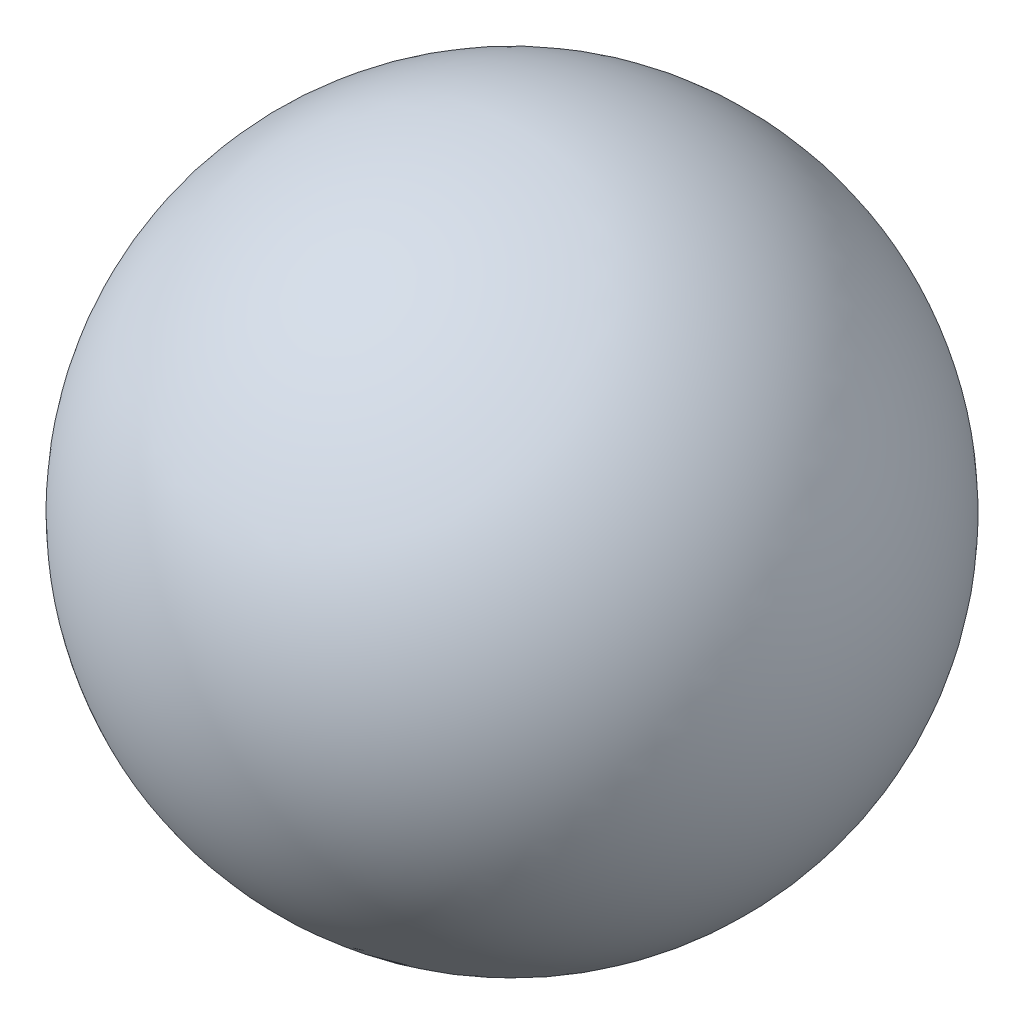
ISO-10303-21;
HEADER;
FILE_DESCRIPTION(('STEP AP214'),'2;1');
FILE_NAME('part.step','',(''),(''),'','','');
FILE_SCHEMA(('AUTOMOTIVE_DESIGN { 1 0 10303 214 1 1 1 1 }'));
ENDSEC;
DATA;
#1=APPLICATION_CONTEXT('core data for automotive mechanical design processes');
#2=APPLICATION_PROTOCOL_DEFINITION('international standard','automotive_design',2000,#1);
#3=PRODUCT_CONTEXT('',#1,'mechanical');
#4=PRODUCT('Part','Part','',(#3));
#5=PRODUCT_RELATED_PRODUCT_CATEGORY('part','',(#4));
#6=PRODUCT_DEFINITION_FORMATION('','',#4);
#7=PRODUCT_DEFINITION_CONTEXT('part definition',#1,'design');
#8=PRODUCT_DEFINITION('design','',#6,#7);
#9=PRODUCT_DEFINITION_SHAPE('','',#8);
#10=(LENGTH_UNIT() NAMED_UNIT(*) SI_UNIT(.MILLI.,.METRE.));
#11=(NAMED_UNIT(*) PLANE_ANGLE_UNIT() SI_UNIT($,.RADIAN.));
#12=(NAMED_UNIT(*) SI_UNIT($,.STERADIAN.) SOLID_ANGLE_UNIT());
#13=UNCERTAINTY_MEASURE_WITH_UNIT(LENGTH_MEASURE(1.E-05),#10,'distance_accuracy_value','');
#14=(GEOMETRIC_REPRESENTATION_CONTEXT(3) GLOBAL_UNCERTAINTY_ASSIGNED_CONTEXT((#13)) GLOBAL_UNIT_ASSIGNED_CONTEXT((#10,
#11,#12)) REPRESENTATION_CONTEXT('',''));
#15=CARTESIAN_POINT('',(0.,0.,0.));
#16=DIRECTION('',(0.,0.,1.));
#17=DIRECTION('',(1.,0.,0.));
#18=AXIS2_PLACEMENT_3D('',#15,#16,#17);
#19=CARTESIAN_POINT('',(64.16,8.84745707434973,68.8165909669866));
#20=DIRECTION('',(0.,0.127516208211661,0.99183648684817));
#21=DIRECTION('',(0.173648177666933,-0.976768261968468,0.125578950481563));
#22=AXIS2_PLACEMENT_3D('',#19,#20,#21);
#23=SPHERICAL_SURFACE('',#22,7.15);
#24=CARTESIAN_POINT('',(64.16,9.7591979630631,75.908221847951));
#25=VERTEX_POINT('',#24);
#26=VERTEX_LOOP('',#25);
#27=FACE_BOUND('',#26,.T.);
#28=CARTESIAN_POINT('',(64.16,7.93571618563635,61.7249600860222));
#29=VERTEX_POINT('',#28);
#30=VERTEX_LOOP('',#29);
#31=FACE_BOUND('',#30,.T.);
#32=ADVANCED_FACE('F15',(#27,#31),#23,.T.);
#33=CLOSED_SHELL('',(#32));
#34=MANIFOLD_SOLID_BREP('B1',#33);
#35=ADVANCED_BREP_SHAPE_REPRESENTATION('',(#18,#34),#14);
#36=SHAPE_DEFINITION_REPRESENTATION(#9,#35);
ENDSEC;
END-ISO-10303-21;
